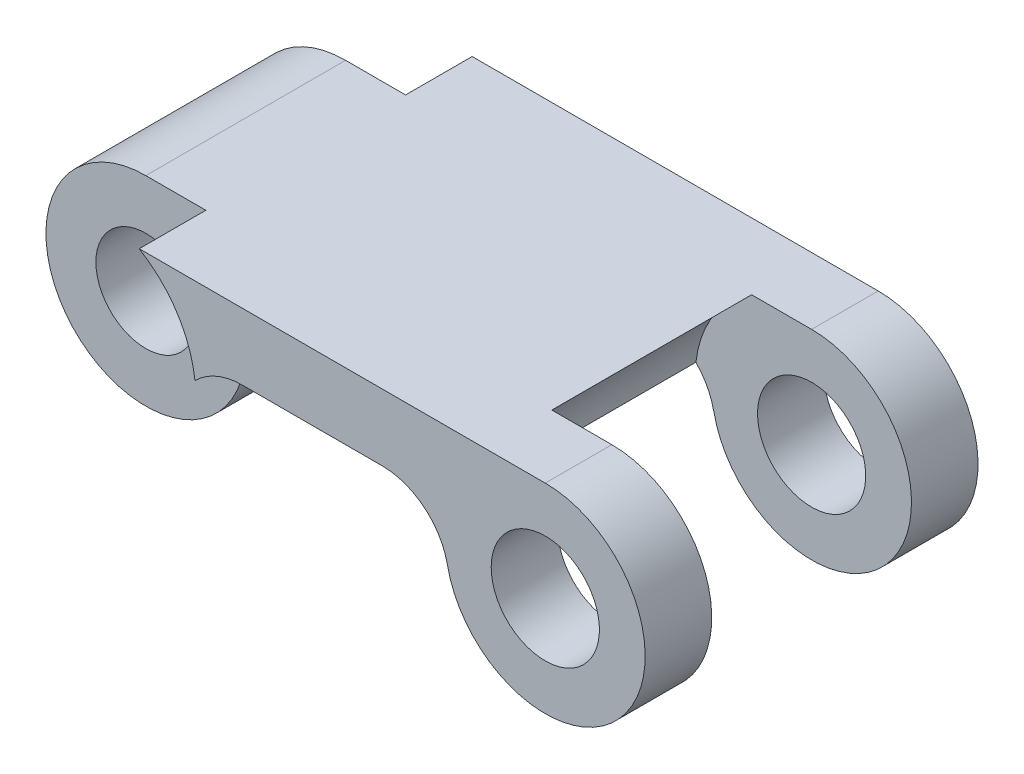
ISO-10303-21;
HEADER;
FILE_DESCRIPTION(('STEP AP214'),'2;1');
FILE_NAME('part.step','',(''),(''),'','','');
FILE_SCHEMA(('AUTOMOTIVE_DESIGN { 1 0 10303 214 1 1 1 1 }'));
ENDSEC;
DATA;
#1=APPLICATION_CONTEXT('core data for automotive mechanical design processes');
#2=APPLICATION_PROTOCOL_DEFINITION('international standard','automotive_design',2000,#1);
#3=PRODUCT_CONTEXT('',#1,'mechanical');
#4=PRODUCT('Part','Part','',(#3));
#5=PRODUCT_RELATED_PRODUCT_CATEGORY('part','',(#4));
#6=PRODUCT_DEFINITION_FORMATION('','',#4);
#7=PRODUCT_DEFINITION_CONTEXT('part definition',#1,'design');
#8=PRODUCT_DEFINITION('design','',#6,#7);
#9=PRODUCT_DEFINITION_SHAPE('','',#8);
#10=(LENGTH_UNIT() NAMED_UNIT(*) SI_UNIT(.MILLI.,.METRE.));
#11=(NAMED_UNIT(*) PLANE_ANGLE_UNIT() SI_UNIT($,.RADIAN.));
#12=(NAMED_UNIT(*) SI_UNIT($,.STERADIAN.) SOLID_ANGLE_UNIT());
#13=UNCERTAINTY_MEASURE_WITH_UNIT(LENGTH_MEASURE(1.E-05),#10,'distance_accuracy_value','');
#14=(GEOMETRIC_REPRESENTATION_CONTEXT(3) GLOBAL_UNCERTAINTY_ASSIGNED_CONTEXT((#13)) GLOBAL_UNIT_ASSIGNED_CONTEXT((#10,
#11,#12)) REPRESENTATION_CONTEXT('',''));
#15=CARTESIAN_POINT('',(0.,0.,0.));
#16=DIRECTION('',(0.,0.,1.));
#17=DIRECTION('',(1.,0.,0.));
#18=AXIS2_PLACEMENT_3D('',#15,#16,#17);
#19=CARTESIAN_POINT('',(-21.9965399719067,9.31366870482719,10.));
#20=DIRECTION('',(0.,1.,0.));
#21=DIRECTION('',(0.,0.,1.));
#22=AXIS2_PLACEMENT_3D('',#19,#20,#21);
#23=PLANE('',#22);
#24=DIRECTION('',(1.,0.,0.));
#25=VECTOR('',#24,1.);
#26=CARTESIAN_POINT('',(-21.9965399719067,9.31366870482719,0.));
#27=LINE('',#26,#25);
#28=CARTESIAN_POINT('',(-19.9259876110865,9.31366870482719,0.));
#29=VERTEX_POINT('',#28);
#30=CARTESIAN_POINT('',(-15.7239465822193,9.31366870482719,0.));
#31=VERTEX_POINT('',#30);
#32=EDGE_CURVE('E277',#29,#31,#27,.T.);
#33=ORIENTED_EDGE('',*,*,#32,.T.);
#34=DIRECTION('',(0.,0.,1.));
#35=VECTOR('',#34,1.);
#36=CARTESIAN_POINT('',(-15.7239465822193,9.31366870482719,2.));
#37=LINE('',#36,#35);
#38=CARTESIAN_POINT('',(-15.7239465822193,9.31366870482719,10.));
#39=VERTEX_POINT('',#38);
#40=EDGE_CURVE('E203',#31,#39,#37,.T.);
#41=ORIENTED_EDGE('',*,*,#40,.T.);
#42=DIRECTION('',(1.,0.,0.));
#43=VECTOR('',#42,1.);
#44=CARTESIAN_POINT('',(-21.9965399719067,9.31366870482719,10.));
#45=LINE('',#44,#43);
#46=CARTESIAN_POINT('',(-19.9259876110865,9.31366870482719,10.));
#47=VERTEX_POINT('',#46);
#48=EDGE_CURVE('E281',#47,#39,#45,.T.);
#49=ORIENTED_EDGE('',*,*,#48,.F.);
#50=DIRECTION('',(0.,0.,1.));
#51=VECTOR('',#50,1.);
#52=CARTESIAN_POINT('',(-19.9259876110865,9.31366870482719,2.));
#53=LINE('',#52,#51);
#54=EDGE_CURVE('E160',#47,#29,#53,.F.);
#55=ORIENTED_EDGE('',*,*,#54,.T.);
#56=EDGE_LOOP('',(#33,#41,#49,#55));
#57=FACE_BOUND('',#56,.T.);
#58=ADVANCED_FACE('F39',(#57),#23,.F.);
#59=CARTESIAN_POINT('',(-10.8249670966529,8.3136687048272,10.));
#60=DIRECTION('',(0.,0.,-1.));
#61=DIRECTION('',(-1.,0.,0.));
#62=AXIS2_PLACEMENT_3D('',#59,#60,#61);
#63=CYLINDRICAL_SURFACE('',#62,3.);
#64=CARTESIAN_POINT('',(-10.8249670966529,8.3136687048272,10.));
#65=DIRECTION('',(0.,0.,1.));
#66=DIRECTION('',(-1.,0.,0.));
#67=AXIS2_PLACEMENT_3D('',#64,#65,#66);
#68=CIRCLE('',#67,3.);
#69=CARTESIAN_POINT('',(-13.7643547879927,7.7136687048272,10.));
#70=VERTEX_POINT('',#69);
#71=CARTESIAN_POINT('',(-10.8249670966529,11.3136687048272,10.));
#72=VERTEX_POINT('',#71);
#73=EDGE_CURVE('E285',#70,#72,#68,.T.);
#74=ORIENTED_EDGE('',*,*,#73,.F.);
#75=DIRECTION('',(0.,0.,-1.));
#76=VECTOR('',#75,1.);
#77=CARTESIAN_POINT('',(-13.7643547879927,7.7136687048272,9.));
#78=LINE('',#77,#76);
#79=CARTESIAN_POINT('',(-13.7643547879927,7.7136687048272,8.));
#80=VERTEX_POINT('',#79);
#81=EDGE_CURVE('E206',#70,#80,#78,.T.);
#82=ORIENTED_EDGE('',*,*,#81,.T.);
#83=CARTESIAN_POINT('',(-10.8249670966529,8.3136687048272,8.));
#84=DIRECTION('',(0.,0.,-1.));
#85=DIRECTION('',(-1.,0.,0.));
#86=AXIS2_PLACEMENT_3D('',#83,#84,#85);
#87=CIRCLE('',#86,3.);
#88=CARTESIAN_POINT('',(-10.8249670966529,11.3136687048272,8.));
#89=VERTEX_POINT('',#88);
#90=EDGE_CURVE('E223',#89,#80,#87,.T.);
#91=ORIENTED_EDGE('',*,*,#90,.F.);
#92=DIRECTION('',(0.,0.,-1.));
#93=VECTOR('',#92,1.);
#94=CARTESIAN_POINT('',(-10.8249670966529,11.3136687048272,10.));
#95=LINE('',#94,#93);
#96=EDGE_CURVE('E306',#72,#89,#95,.T.);
#97=ORIENTED_EDGE('',*,*,#96,.F.);
#98=EDGE_LOOP('',(#74,#82,#91,#97));
#99=FACE_BOUND('',#98,.T.);
#100=ADVANCED_FACE('F334',(#99),#63,.T.);
#101=CARTESIAN_POINT('',(-24.8249670966529,11.3136687048272,10.));
#102=DIRECTION('',(0.,-1.,0.));
#103=DIRECTION('',(0.,0.,-1.));
#104=AXIS2_PLACEMENT_3D('',#101,#102,#103);
#105=PLANE('',#104);
#106=DIRECTION('',(1.,0.,0.));
#107=VECTOR('',#106,1.);
#108=CARTESIAN_POINT('',(-24.8249670966529,11.3136687048272,8.));
#109=LINE('',#108,#107);
#110=CARTESIAN_POINT('',(-12.6277427343849,11.3136687048272,8.));
#111=VERTEX_POINT('',#110);
#112=EDGE_CURVE('E158',#111,#89,#109,.T.);
#113=ORIENTED_EDGE('',*,*,#112,.F.);
#114=DIRECTION('',(0.,0.,-1.));
#115=VECTOR('',#114,1.);
#116=CARTESIAN_POINT('',(-12.6277427343849,11.3136687048272,8.));
#117=LINE('',#116,#115);
#118=CARTESIAN_POINT('',(-12.6277427343849,11.3136687048272,2.));
#119=VERTEX_POINT('',#118);
#120=EDGE_CURVE('E150',#111,#119,#117,.T.);
#121=ORIENTED_EDGE('',*,*,#120,.T.);
#122=DIRECTION('',(1.,0.,0.));
#123=VECTOR('',#122,1.);
#124=CARTESIAN_POINT('',(-24.8249670966529,11.3136687048272,2.));
#125=LINE('',#124,#123);
#126=CARTESIAN_POINT('',(-10.8249670966529,11.3136687048272,2.));
#127=VERTEX_POINT('',#126);
#128=EDGE_CURVE('E138',#119,#127,#125,.T.);
#129=ORIENTED_EDGE('',*,*,#128,.T.);
#130=CARTESIAN_POINT('',(-10.8249670966529,11.3136687048272,0.));
#131=VERTEX_POINT('',#130);
#132=EDGE_CURVE('E231',#127,#131,#95,.T.);
#133=ORIENTED_EDGE('',*,*,#132,.T.);
#134=DIRECTION('',(-1.,0.,0.));
#135=VECTOR('',#134,1.);
#136=CARTESIAN_POINT('',(-24.8249670966529,11.3136687048272,0.));
#137=LINE('',#136,#135);
#138=CARTESIAN_POINT('',(-23.0221914589209,11.3136687048272,0.));
#139=VERTEX_POINT('',#138);
#140=EDGE_CURVE('E286',#131,#139,#137,.T.);
#141=ORIENTED_EDGE('',*,*,#140,.T.);
#142=DIRECTION('',(0.,0.,-1.));
#143=VECTOR('',#142,1.);
#144=CARTESIAN_POINT('',(-23.0221914589209,11.3136687048272,2.));
#145=LINE('',#144,#143);
#146=CARTESIAN_POINT('',(-23.0221914589209,11.3136687048272,2.));
#147=VERTEX_POINT('',#146);
#148=EDGE_CURVE('E268',#139,#147,#145,.F.);
#149=ORIENTED_EDGE('',*,*,#148,.T.);
#150=DIRECTION('',(1.,0.,0.));
#151=VECTOR('',#150,1.);
#152=CARTESIAN_POINT('',(-24.8249670966529,11.3136687048272,2.));
#153=LINE('',#152,#151);
#154=CARTESIAN_POINT('',(-24.8249670966529,11.3136687048272,2.));
#155=VERTEX_POINT('',#154);
#156=EDGE_CURVE('E262',#155,#147,#153,.T.);
#157=ORIENTED_EDGE('',*,*,#156,.F.);
#158=DIRECTION('',(0.,0.,-1.));
#159=VECTOR('',#158,1.);
#160=CARTESIAN_POINT('',(-24.8249670966529,11.3136687048272,10.));
#161=LINE('',#160,#159);
#162=CARTESIAN_POINT('',(-24.8249670966529,11.3136687048272,8.));
#163=VERTEX_POINT('',#162);
#164=EDGE_CURVE('E293',#163,#155,#161,.T.);
#165=ORIENTED_EDGE('',*,*,#164,.F.);
#166=DIRECTION('',(1.,0.,0.));
#167=VECTOR('',#166,1.);
#168=CARTESIAN_POINT('',(-24.8249670966529,11.3136687048272,8.));
#169=LINE('',#168,#167);
#170=CARTESIAN_POINT('',(-23.0221914589209,11.3136687048272,8.));
#171=VERTEX_POINT('',#170);
#172=EDGE_CURVE('E161',#163,#171,#169,.T.);
#173=ORIENTED_EDGE('',*,*,#172,.T.);
#174=DIRECTION('',(0.,0.,-1.));
#175=VECTOR('',#174,1.);
#176=CARTESIAN_POINT('',(-23.0221914589209,11.3136687048272,20.));
#177=LINE('',#176,#175);
#178=CARTESIAN_POINT('',(-23.0221914589209,11.3136687048272,10.));
#179=VERTEX_POINT('',#178);
#180=EDGE_CURVE('E244',#171,#179,#177,.F.);
#181=ORIENTED_EDGE('',*,*,#180,.T.);
#182=DIRECTION('',(-1.,0.,0.));
#183=VECTOR('',#182,1.);
#184=CARTESIAN_POINT('',(-24.8249670966529,11.3136687048272,10.));
#185=LINE('',#184,#183);
#186=EDGE_CURVE('E289',#72,#179,#185,.T.);
#187=ORIENTED_EDGE('',*,*,#186,.F.);
#188=ORIENTED_EDGE('',*,*,#96,.T.);
#189=EDGE_LOOP('',(#113,#121,#129,#133,#141,#149,#157,#165,#173,#181,#187,#188));
#190=FACE_BOUND('',#189,.T.);
#191=ADVANCED_FACE('F156',(#190),#105,.F.);
#192=CARTESIAN_POINT('',(-10.8249670966529,8.3136687048272,10.));
#193=DIRECTION('',(0.,0.,-1.));
#194=DIRECTION('',(-1.,0.,0.));
#195=AXIS2_PLACEMENT_3D('',#192,#193,#194);
#196=CYLINDRICAL_SURFACE('',#195,1.625);
#197=CARTESIAN_POINT('',(-10.8249670966529,8.3136687048272,10.));
#198=DIRECTION('',(0.,0.,-1.));
#199=DIRECTION('',(-1.,0.,0.));
#200=AXIS2_PLACEMENT_3D('',#197,#198,#199);
#201=CIRCLE('',#200,1.625);
#202=CARTESIAN_POINT('',(-12.4499670966529,8.3136687048272,10.));
#203=VERTEX_POINT('',#202);
#204=EDGE_CURVE('E273',#203,#203,#201,.T.);
#205=ORIENTED_EDGE('',*,*,#204,.F.);
#206=EDGE_LOOP('',(#205));
#207=FACE_BOUND('',#206,.T.);
#208=CARTESIAN_POINT('',(-10.8249670966529,8.3136687048272,8.));
#209=DIRECTION('',(0.,0.,-1.));
#210=DIRECTION('',(-1.,0.,0.));
#211=AXIS2_PLACEMENT_3D('',#208,#209,#210);
#212=CIRCLE('',#211,1.625);
#213=CARTESIAN_POINT('',(-12.4499670966529,8.3136687048272,8.));
#214=VERTEX_POINT('',#213);
#215=EDGE_CURVE('E172',#214,#214,#212,.F.);
#216=ORIENTED_EDGE('',*,*,#215,.F.);
#217=EDGE_LOOP('',(#216));
#218=FACE_BOUND('',#217,.T.);
#219=ADVANCED_FACE('F347',(#207,#218),#196,.F.);
#220=CARTESIAN_POINT('',(-24.8249670966529,8.3136687048272,10.));
#221=DIRECTION('',(0.,0.,-1.));
#222=DIRECTION('',(-1.,0.,0.));
#223=AXIS2_PLACEMENT_3D('',#220,#221,#222);
#224=CYLINDRICAL_SURFACE('',#223,3.);
#225=CARTESIAN_POINT('',(-24.8249670966529,8.3136687048272,2.));
#226=DIRECTION('',(0.,0.,-1.));
#227=DIRECTION('',(-1.,0.,0.));
#228=AXIS2_PLACEMENT_3D('',#225,#226,#227);
#229=CIRCLE('',#228,3.);
#230=CARTESIAN_POINT('',(-21.8855794053131,7.7136687048272,2.));
#231=VERTEX_POINT('',#230);
#232=EDGE_CURVE('E265',#231,#155,#229,.T.);
#233=ORIENTED_EDGE('',*,*,#232,.F.);
#234=DIRECTION('',(0.,0.,-1.));
#235=VECTOR('',#234,1.);
#236=CARTESIAN_POINT('',(-21.8855794053131,7.7136687048272,10.));
#237=LINE('',#236,#235);
#238=CARTESIAN_POINT('',(-21.8855794053131,7.7136687048272,8.));
#239=VERTEX_POINT('',#238);
#240=EDGE_CURVE('E166',#231,#239,#237,.F.);
#241=ORIENTED_EDGE('',*,*,#240,.T.);
#242=CARTESIAN_POINT('',(-24.8249670966529,8.3136687048272,8.));
#243=DIRECTION('',(0.,0.,-1.));
#244=DIRECTION('',(-1.,0.,0.));
#245=AXIS2_PLACEMENT_3D('',#242,#243,#244);
#246=CIRCLE('',#245,3.);
#247=EDGE_CURVE('E248',#239,#163,#246,.T.);
#248=ORIENTED_EDGE('',*,*,#247,.T.);
#249=ORIENTED_EDGE('',*,*,#164,.T.);
#250=EDGE_LOOP('',(#233,#241,#248,#249));
#251=FACE_BOUND('',#250,.T.);
#252=ADVANCED_FACE('F344',(#251),#224,.T.);
#253=CARTESIAN_POINT('',(-24.8249670966529,8.3136687048272,10.));
#254=DIRECTION('',(0.,0.,-1.));
#255=DIRECTION('',(-1.,0.,0.));
#256=AXIS2_PLACEMENT_3D('',#253,#254,#255);
#257=CYLINDRICAL_SURFACE('',#256,1.5);
#258=CARTESIAN_POINT('',(-24.8249670966529,8.3136687048272,8.));
#259=DIRECTION('',(0.,0.,-1.));
#260=DIRECTION('',(-1.,0.,0.));
#261=AXIS2_PLACEMENT_3D('',#258,#259,#260);
#262=CIRCLE('',#261,1.5);
#263=CARTESIAN_POINT('',(-26.3249670966529,8.3136687048272,8.));
#264=VERTEX_POINT('',#263);
#265=EDGE_CURVE('E251',#264,#264,#262,.F.);
#266=ORIENTED_EDGE('',*,*,#265,.T.);
#267=EDGE_LOOP('',(#266));
#268=FACE_BOUND('',#267,.T.);
#269=CARTESIAN_POINT('',(-24.8249670966529,8.3136687048272,2.));
#270=DIRECTION('',(0.,0.,-1.));
#271=DIRECTION('',(-1.,0.,0.));
#272=AXIS2_PLACEMENT_3D('',#269,#270,#271);
#273=CIRCLE('',#272,1.5);
#274=CARTESIAN_POINT('',(-26.3249670966529,8.3136687048272,2.));
#275=VERTEX_POINT('',#274);
#276=EDGE_CURVE('E259',#275,#275,#273,.F.);
#277=ORIENTED_EDGE('',*,*,#276,.F.);
#278=EDGE_LOOP('',(#277));
#279=FACE_BOUND('',#278,.T.);
#280=ADVANCED_FACE('F346',(#268,#279),#257,.F.);
#281=CARTESIAN_POINT('',(-10.8249670966529,8.3136687048272,2.));
#282=DIRECTION('',(0.,0.,-1.));
#283=DIRECTION('',(-1.,0.,0.));
#284=AXIS2_PLACEMENT_3D('',#281,#282,#283);
#285=CIRCLE('',#284,3.);
#286=CARTESIAN_POINT('',(-13.7643547879927,7.7136687048272,2.));
#287=VERTEX_POINT('',#286);
#288=EDGE_CURVE('E141',#127,#287,#285,.T.);
#289=ORIENTED_EDGE('',*,*,#288,.T.);
#290=DIRECTION('',(0.,0.,-1.));
#291=VECTOR('',#290,1.);
#292=CARTESIAN_POINT('',(-13.7643547879927,7.7136687048272,10.));
#293=LINE('',#292,#291);
#294=CARTESIAN_POINT('',(-13.7643547879927,7.7136687048272,0.));
#295=VERTEX_POINT('',#294);
#296=EDGE_CURVE('E199',#287,#295,#293,.T.);
#297=ORIENTED_EDGE('',*,*,#296,.T.);
#298=CARTESIAN_POINT('',(-10.8249670966529,8.3136687048272,0.));
#299=DIRECTION('',(0.,0.,1.));
#300=DIRECTION('',(-1.,0.,0.));
#301=AXIS2_PLACEMENT_3D('',#298,#299,#300);
#302=CIRCLE('',#301,3.);
#303=EDGE_CURVE('E297',#295,#131,#302,.T.);
#304=ORIENTED_EDGE('',*,*,#303,.T.);
#305=ORIENTED_EDGE('',*,*,#132,.F.);
#306=EDGE_LOOP('',(#289,#297,#304,#305));
#307=FACE_BOUND('',#306,.T.);
#308=ADVANCED_FACE('F229',(#307),#63,.T.);
#309=CARTESIAN_POINT('',(-24.8249670966529,8.3136687048272,10.));
#310=DIRECTION('',(0.,0.,1.));
#311=DIRECTION('',(1.,0.,0.));
#312=AXIS2_PLACEMENT_3D('',#309,#310,#311);
#313=PLANE('',#312);
#314=CARTESIAN_POINT('',(-24.8249670966529,8.3136687048272,10.));
#315=DIRECTION('',(0.,0.,1.));
#316=DIRECTION('',(1.,0.,0.));
#317=AXIS2_PLACEMENT_3D('',#314,#315,#316);
#318=CIRCLE('',#317,3.5);
#319=CARTESIAN_POINT('',(-21.3485708088073,8.71946280268168,10.));
#320=VERTEX_POINT('',#319);
#321=EDGE_CURVE('E169',#320,#179,#318,.T.);
#322=ORIENTED_EDGE('',*,*,#321,.F.);
#323=CARTESIAN_POINT('',(-19.9259876110865,7.31366870482719,10.));
#324=DIRECTION('',(0.,0.,1.));
#325=DIRECTION('',(1.,0.,0.));
#326=AXIS2_PLACEMENT_3D('',#323,#324,#325);
#327=CIRCLE('',#326,2.);
#328=EDGE_CURVE('E196',#320,#47,#327,.F.);
#329=ORIENTED_EDGE('',*,*,#328,.T.);
#330=ORIENTED_EDGE('',*,*,#48,.T.);
#331=CARTESIAN_POINT('',(-15.7239465822193,7.31366870482719,10.));
#332=DIRECTION('',(0.,0.,1.));
#333=DIRECTION('',(1.,0.,0.));
#334=AXIS2_PLACEMENT_3D('',#331,#332,#333);
#335=CIRCLE('',#334,2.);
#336=EDGE_CURVE('E212',#39,#70,#335,.F.);
#337=ORIENTED_EDGE('',*,*,#336,.T.);
#338=ORIENTED_EDGE('',*,*,#73,.T.);
#339=ORIENTED_EDGE('',*,*,#186,.T.);
#340=EDGE_LOOP('',(#322,#329,#330,#337,#338,#339));
#341=FACE_BOUND('',#340,.T.);
#342=ORIENTED_EDGE('',*,*,#204,.T.);
#343=EDGE_LOOP('',(#342));
#344=FACE_BOUND('',#343,.T.);
#345=ADVANCED_FACE('F386',(#341,#344),#313,.T.);
#346=CARTESIAN_POINT('',(-24.8249670966529,8.3136687048272,0.));
#347=DIRECTION('',(0.,0.,1.));
#348=DIRECTION('',(1.,0.,0.));
#349=AXIS2_PLACEMENT_3D('',#346,#347,#348);
#350=PLANE('',#349);
#351=CARTESIAN_POINT('',(-10.8249670966529,8.3136687048272,0.));
#352=DIRECTION('',(0.,0.,-1.));
#353=DIRECTION('',(-1.,0.,0.));
#354=AXIS2_PLACEMENT_3D('',#351,#352,#353);
#355=CIRCLE('',#354,1.625);
#356=CARTESIAN_POINT('',(-12.4499670966529,8.3136687048272,0.));
#357=VERTEX_POINT('',#356);
#358=EDGE_CURVE('E272',#357,#357,#355,.T.);
#359=ORIENTED_EDGE('',*,*,#358,.F.);
#360=EDGE_LOOP('',(#359));
#361=FACE_BOUND('',#360,.T.);
#362=ORIENTED_EDGE('',*,*,#32,.F.);
#363=CARTESIAN_POINT('',(-19.9259876110865,7.31366870482719,0.));
#364=DIRECTION('',(0.,0.,1.));
#365=DIRECTION('',(1.,0.,0.));
#366=AXIS2_PLACEMENT_3D('',#363,#364,#365);
#367=CIRCLE('',#366,2.);
#368=CARTESIAN_POINT('',(-21.3485708088073,8.71946280268168,0.));
#369=VERTEX_POINT('',#368);
#370=EDGE_CURVE('E177',#29,#369,#367,.T.);
#371=ORIENTED_EDGE('',*,*,#370,.T.);
#372=CARTESIAN_POINT('',(-24.8249670966529,8.3136687048272,0.));
#373=DIRECTION('',(0.,0.,-1.));
#374=DIRECTION('',(-1.,0.,0.));
#375=AXIS2_PLACEMENT_3D('',#372,#373,#374);
#376=CIRCLE('',#375,3.5);
#377=EDGE_CURVE('E255',#139,#369,#376,.T.);
#378=ORIENTED_EDGE('',*,*,#377,.F.);
#379=ORIENTED_EDGE('',*,*,#140,.F.);
#380=ORIENTED_EDGE('',*,*,#303,.F.);
#381=CARTESIAN_POINT('',(-15.7239465822193,7.31366870482719,0.));
#382=DIRECTION('',(0.,0.,1.));
#383=DIRECTION('',(1.,0.,0.));
#384=AXIS2_PLACEMENT_3D('',#381,#382,#383);
#385=CIRCLE('',#384,2.);
#386=EDGE_CURVE('E209',#295,#31,#385,.T.);
#387=ORIENTED_EDGE('',*,*,#386,.T.);
#388=EDGE_LOOP('',(#362,#371,#378,#379,#380,#387));
#389=FACE_BOUND('',#388,.T.);
#390=ADVANCED_FACE('F383',(#361,#389),#350,.F.);
#391=CARTESIAN_POINT('',(-10.8249670966529,8.3136687048272,2.));
#392=DIRECTION('',(0.,0.,-1.));
#393=DIRECTION('',(-1.,0.,0.));
#394=AXIS2_PLACEMENT_3D('',#391,#392,#393);
#395=CIRCLE('',#394,1.625);
#396=CARTESIAN_POINT('',(-12.4499670966529,8.3136687048272,2.));
#397=VERTEX_POINT('',#396);
#398=EDGE_CURVE('E147',#397,#397,#395,.F.);
#399=ORIENTED_EDGE('',*,*,#398,.T.);
#400=EDGE_LOOP('',(#399));
#401=FACE_BOUND('',#400,.T.);
#402=ORIENTED_EDGE('',*,*,#358,.T.);
#403=EDGE_LOOP('',(#402));
#404=FACE_BOUND('',#403,.T.);
#405=ADVANCED_FACE('F319',(#401,#404),#196,.F.);
#406=CARTESIAN_POINT('',(-24.8249670966529,8.3136687048272,2.));
#407=DIRECTION('',(0.,0.,-1.));
#408=DIRECTION('',(-1.,0.,0.));
#409=AXIS2_PLACEMENT_3D('',#406,#407,#408);
#410=CYLINDRICAL_SURFACE('',#409,3.5);
#411=CARTESIAN_POINT('',(-24.8249670966529,8.3136687048272,2.));
#412=DIRECTION('',(0.,0.,-1.));
#413=DIRECTION('',(-1.,0.,0.));
#414=AXIS2_PLACEMENT_3D('',#411,#412,#413);
#415=CIRCLE('',#414,3.5);
#416=CARTESIAN_POINT('',(-21.3485708088073,8.71946280268168,2.));
#417=VERTEX_POINT('',#416);
#418=EDGE_CURVE('E256',#147,#417,#415,.T.);
#419=ORIENTED_EDGE('',*,*,#418,.F.);
#420=ORIENTED_EDGE('',*,*,#148,.F.);
#421=ORIENTED_EDGE('',*,*,#377,.T.);
#422=DIRECTION('',(0.,0.,-1.));
#423=VECTOR('',#422,1.);
#424=CARTESIAN_POINT('',(-21.3485708088073,8.71946280268168,0.));
#425=LINE('',#424,#423);
#426=EDGE_CURVE('E181',#369,#417,#425,.F.);
#427=ORIENTED_EDGE('',*,*,#426,.T.);
#428=EDGE_LOOP('',(#419,#420,#421,#427));
#429=FACE_BOUND('',#428,.T.);
#430=ADVANCED_FACE('F376',(#429),#410,.F.);
#431=CARTESIAN_POINT('',(-24.8249670966529,8.3136687048272,2.));
#432=DIRECTION('',(0.,0.,-1.));
#433=DIRECTION('',(-1.,0.,0.));
#434=AXIS2_PLACEMENT_3D('',#431,#432,#433);
#435=PLANE('',#434);
#436=ORIENTED_EDGE('',*,*,#276,.T.);
#437=EDGE_LOOP('',(#436));
#438=FACE_BOUND('',#437,.T.);
#439=ORIENTED_EDGE('',*,*,#418,.T.);
#440=CARTESIAN_POINT('',(-19.9259876110865,7.31366870482719,2.));
#441=DIRECTION('',(0.,0.,-1.));
#442=DIRECTION('',(-1.,0.,0.));
#443=AXIS2_PLACEMENT_3D('',#440,#441,#442);
#444=CIRCLE('',#443,2.);
#445=EDGE_CURVE('E185',#417,#231,#444,.F.);
#446=ORIENTED_EDGE('',*,*,#445,.T.);
#447=ORIENTED_EDGE('',*,*,#232,.T.);
#448=ORIENTED_EDGE('',*,*,#156,.T.);
#449=EDGE_LOOP('',(#439,#446,#447,#448));
#450=FACE_BOUND('',#449,.T.);
#451=ADVANCED_FACE('F374',(#438,#450),#435,.T.);
#452=CARTESIAN_POINT('',(-24.8249670966529,8.3136687048272,8.));
#453=DIRECTION('',(0.,0.,-1.));
#454=DIRECTION('',(-1.,0.,0.));
#455=AXIS2_PLACEMENT_3D('',#452,#453,#454);
#456=PLANE('',#455);
#457=CARTESIAN_POINT('',(-24.8249670966529,8.3136687048272,8.));
#458=DIRECTION('',(0.,0.,-1.));
#459=DIRECTION('',(-1.,0.,0.));
#460=AXIS2_PLACEMENT_3D('',#457,#458,#459);
#461=CIRCLE('',#460,3.5);
#462=CARTESIAN_POINT('',(-21.3485708088073,8.71946280268168,8.));
#463=VERTEX_POINT('',#462);
#464=EDGE_CURVE('E241',#171,#463,#461,.T.);
#465=ORIENTED_EDGE('',*,*,#464,.F.);
#466=ORIENTED_EDGE('',*,*,#172,.F.);
#467=ORIENTED_EDGE('',*,*,#247,.F.);
#468=CARTESIAN_POINT('',(-19.9259876110865,7.31366870482719,8.));
#469=DIRECTION('',(0.,0.,-1.));
#470=DIRECTION('',(-1.,0.,0.));
#471=AXIS2_PLACEMENT_3D('',#468,#469,#470);
#472=CIRCLE('',#471,2.);
#473=EDGE_CURVE('E188',#239,#463,#472,.T.);
#474=ORIENTED_EDGE('',*,*,#473,.T.);
#475=EDGE_LOOP('',(#465,#466,#467,#474));
#476=FACE_BOUND('',#475,.T.);
#477=ORIENTED_EDGE('',*,*,#265,.F.);
#478=EDGE_LOOP('',(#477));
#479=FACE_BOUND('',#478,.T.);
#480=ADVANCED_FACE('F370',(#476,#479),#456,.F.);
#481=CARTESIAN_POINT('',(-24.8249670966529,8.3136687048272,20.));
#482=DIRECTION('',(0.,0.,-1.));
#483=DIRECTION('',(-1.,0.,0.));
#484=AXIS2_PLACEMENT_3D('',#481,#482,#483);
#485=CYLINDRICAL_SURFACE('',#484,3.5);
#486=ORIENTED_EDGE('',*,*,#321,.T.);
#487=ORIENTED_EDGE('',*,*,#180,.F.);
#488=ORIENTED_EDGE('',*,*,#464,.T.);
#489=DIRECTION('',(0.,0.,-1.));
#490=VECTOR('',#489,1.);
#491=CARTESIAN_POINT('',(-21.3485708088073,8.71946280268168,8.));
#492=LINE('',#491,#490);
#493=EDGE_CURVE('E192',#463,#320,#492,.F.);
#494=ORIENTED_EDGE('',*,*,#493,.T.);
#495=EDGE_LOOP('',(#486,#487,#488,#494));
#496=FACE_BOUND('',#495,.T.);
#497=ADVANCED_FACE('F391',(#496),#485,.F.);
#498=CARTESIAN_POINT('',(-10.8249670966529,8.3136687048272,8.));
#499=DIRECTION('',(0.,0.,-1.));
#500=DIRECTION('',(-1.,0.,0.));
#501=AXIS2_PLACEMENT_3D('',#498,#499,#500);
#502=CYLINDRICAL_SURFACE('',#501,3.5);
#503=CARTESIAN_POINT('',(-10.8249670966529,8.3136687048272,2.));
#504=DIRECTION('',(0.,0.,-1.));
#505=DIRECTION('',(-1.,0.,0.));
#506=AXIS2_PLACEMENT_3D('',#503,#504,#505);
#507=CIRCLE('',#506,3.5);
#508=CARTESIAN_POINT('',(-14.3013633844985,8.71946280268168,2.));
#509=VERTEX_POINT('',#508);
#510=EDGE_CURVE('E54',#509,#119,#507,.T.);
#511=ORIENTED_EDGE('',*,*,#510,.T.);
#512=ORIENTED_EDGE('',*,*,#120,.F.);
#513=CARTESIAN_POINT('',(-10.8249670966529,8.3136687048272,8.));
#514=DIRECTION('',(0.,0.,-1.));
#515=DIRECTION('',(-1.,0.,0.));
#516=AXIS2_PLACEMENT_3D('',#513,#514,#515);
#517=CIRCLE('',#516,3.5);
#518=CARTESIAN_POINT('',(-14.3013633844985,8.71946280268168,8.));
#519=VERTEX_POINT('',#518);
#520=EDGE_CURVE('E61',#519,#111,#517,.T.);
#521=ORIENTED_EDGE('',*,*,#520,.F.);
#522=DIRECTION('',(0.,0.,-1.));
#523=VECTOR('',#522,1.);
#524=CARTESIAN_POINT('',(-14.3013633844985,8.71946280268168,8.));
#525=LINE('',#524,#523);
#526=EDGE_CURVE('E48',#519,#509,#525,.T.);
#527=ORIENTED_EDGE('',*,*,#526,.T.);
#528=EDGE_LOOP('',(#511,#512,#521,#527));
#529=FACE_BOUND('',#528,.T.);
#530=ADVANCED_FACE('F149',(#529),#502,.F.);
#531=CARTESIAN_POINT('',(-10.8249670966529,8.3136687048272,8.));
#532=DIRECTION('',(0.,0.,-1.));
#533=DIRECTION('',(-1.,0.,0.));
#534=AXIS2_PLACEMENT_3D('',#531,#532,#533);
#535=PLANE('',#534);
#536=ORIENTED_EDGE('',*,*,#215,.T.);
#537=EDGE_LOOP('',(#536));
#538=FACE_BOUND('',#537,.T.);
#539=ORIENTED_EDGE('',*,*,#90,.T.);
#540=CARTESIAN_POINT('',(-15.7239465822193,7.31366870482719,8.));
#541=DIRECTION('',(0.,0.,-1.));
#542=DIRECTION('',(-1.,0.,0.));
#543=AXIS2_PLACEMENT_3D('',#540,#541,#542);
#544=CIRCLE('',#543,2.);
#545=EDGE_CURVE('E215',#80,#519,#544,.F.);
#546=ORIENTED_EDGE('',*,*,#545,.T.);
#547=ORIENTED_EDGE('',*,*,#520,.T.);
#548=ORIENTED_EDGE('',*,*,#112,.T.);
#549=EDGE_LOOP('',(#539,#546,#547,#548));
#550=FACE_BOUND('',#549,.T.);
#551=ADVANCED_FACE('F221',(#538,#550),#535,.T.);
#552=CARTESIAN_POINT('',(-10.8249670966529,8.3136687048272,2.));
#553=DIRECTION('',(0.,0.,-1.));
#554=DIRECTION('',(-1.,0.,0.));
#555=AXIS2_PLACEMENT_3D('',#552,#553,#554);
#556=PLANE('',#555);
#557=ORIENTED_EDGE('',*,*,#398,.F.);
#558=EDGE_LOOP('',(#557));
#559=FACE_BOUND('',#558,.T.);
#560=ORIENTED_EDGE('',*,*,#288,.F.);
#561=ORIENTED_EDGE('',*,*,#128,.F.);
#562=ORIENTED_EDGE('',*,*,#510,.F.);
#563=CARTESIAN_POINT('',(-15.7239465822193,7.31366870482719,2.));
#564=DIRECTION('',(0.,0.,-1.));
#565=DIRECTION('',(-1.,0.,0.));
#566=AXIS2_PLACEMENT_3D('',#563,#564,#565);
#567=CIRCLE('',#566,2.);
#568=EDGE_CURVE('E11',#509,#287,#567,.T.);
#569=ORIENTED_EDGE('',*,*,#568,.T.);
#570=EDGE_LOOP('',(#560,#561,#562,#569));
#571=FACE_BOUND('',#570,.T.);
#572=ADVANCED_FACE('F139',(#559,#571),#556,.F.);
#573=CARTESIAN_POINT('',(-19.9259876110865,7.31366870482719,10.));
#574=DIRECTION('',(0.,0.,-1.));
#575=DIRECTION('',(-1.,0.,0.));
#576=AXIS2_PLACEMENT_3D('',#573,#574,#575);
#577=CYLINDRICAL_SURFACE('',#576,2.);
#578=ORIENTED_EDGE('',*,*,#473,.F.);
#579=ORIENTED_EDGE('',*,*,#240,.F.);
#580=ORIENTED_EDGE('',*,*,#445,.F.);
#581=ORIENTED_EDGE('',*,*,#426,.F.);
#582=ORIENTED_EDGE('',*,*,#370,.F.);
#583=ORIENTED_EDGE('',*,*,#54,.F.);
#584=ORIENTED_EDGE('',*,*,#328,.F.);
#585=ORIENTED_EDGE('',*,*,#493,.F.);
#586=EDGE_LOOP('',(#578,#579,#580,#581,#582,#583,#584,#585));
#587=FACE_BOUND('',#586,.T.);
#588=ADVANCED_FACE('F323',(#587),#577,.F.);
#589=CARTESIAN_POINT('',(-15.7239465822193,7.31366870482719,10.));
#590=DIRECTION('',(0.,0.,-1.));
#591=DIRECTION('',(-1.,0.,0.));
#592=AXIS2_PLACEMENT_3D('',#589,#590,#591);
#593=CYLINDRICAL_SURFACE('',#592,2.);
#594=ORIENTED_EDGE('',*,*,#336,.F.);
#595=ORIENTED_EDGE('',*,*,#40,.F.);
#596=ORIENTED_EDGE('',*,*,#386,.F.);
#597=ORIENTED_EDGE('',*,*,#296,.F.);
#598=ORIENTED_EDGE('',*,*,#568,.F.);
#599=ORIENTED_EDGE('',*,*,#526,.F.);
#600=ORIENTED_EDGE('',*,*,#545,.F.);
#601=ORIENTED_EDGE('',*,*,#81,.F.);
#602=EDGE_LOOP('',(#594,#595,#596,#597,#598,#599,#600,#601));
#603=FACE_BOUND('',#602,.T.);
#604=ADVANCED_FACE('F41',(#603),#593,.F.);
#605=CLOSED_SHELL('',(#58,#100,#191,#219,#252,#280,#308,#345,#390,#405,#430,#451,#480,#497,#530,
#551,#572,#588,#604));
#606=MANIFOLD_SOLID_BREP('B2',#605);
#607=ADVANCED_BREP_SHAPE_REPRESENTATION('',(#18,#606),#14);
#608=SHAPE_DEFINITION_REPRESENTATION(#9,#607);
ENDSEC;
END-ISO-10303-21;
